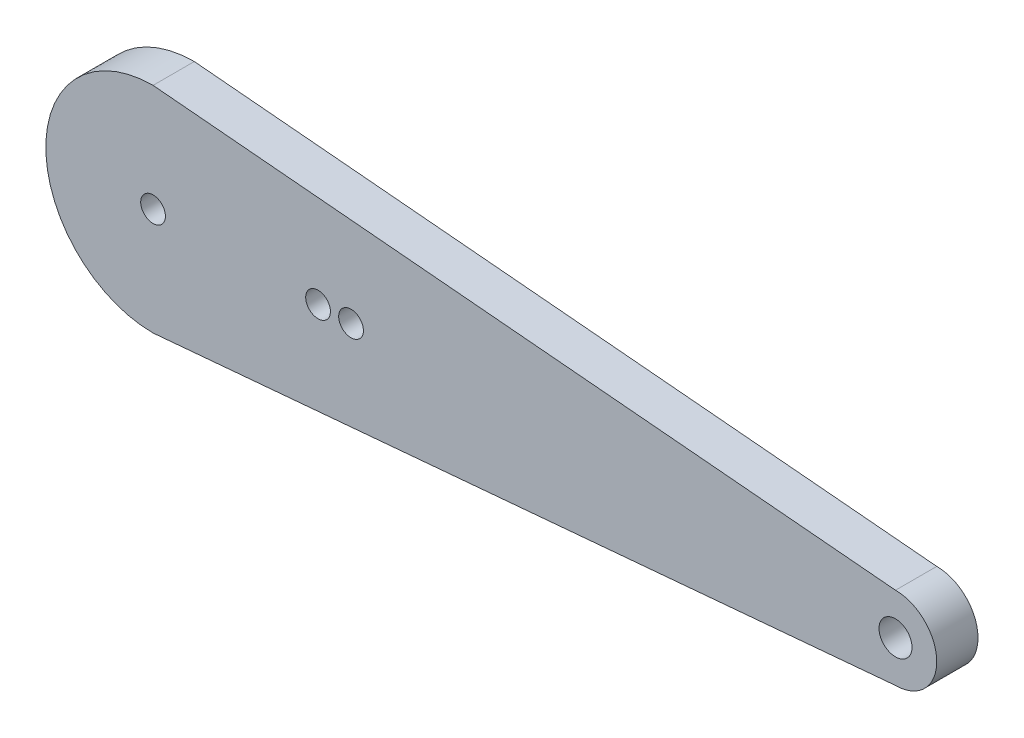
ISO-10303-21;
HEADER;
FILE_DESCRIPTION(('STEP AP214'),'2;1');
FILE_NAME('part.step','',(''),(''),'','','');
FILE_SCHEMA(('AUTOMOTIVE_DESIGN { 1 0 10303 214 1 1 1 1 }'));
ENDSEC;
DATA;
#1=APPLICATION_CONTEXT('core data for automotive mechanical design processes');
#2=APPLICATION_PROTOCOL_DEFINITION('international standard','automotive_design',2000,#1);
#3=PRODUCT_CONTEXT('',#1,'mechanical');
#4=PRODUCT('Part','Part','',(#3));
#5=PRODUCT_RELATED_PRODUCT_CATEGORY('part','',(#4));
#6=PRODUCT_DEFINITION_FORMATION('','',#4);
#7=PRODUCT_DEFINITION_CONTEXT('part definition',#1,'design');
#8=PRODUCT_DEFINITION('design','',#6,#7);
#9=PRODUCT_DEFINITION_SHAPE('','',#8);
#10=(LENGTH_UNIT() NAMED_UNIT(*) SI_UNIT(.MILLI.,.METRE.));
#11=(NAMED_UNIT(*) PLANE_ANGLE_UNIT() SI_UNIT($,.RADIAN.));
#12=(NAMED_UNIT(*) SI_UNIT($,.STERADIAN.) SOLID_ANGLE_UNIT());
#13=UNCERTAINTY_MEASURE_WITH_UNIT(LENGTH_MEASURE(1.E-05),#10,'distance_accuracy_value','');
#14=(GEOMETRIC_REPRESENTATION_CONTEXT(3) GLOBAL_UNCERTAINTY_ASSIGNED_CONTEXT((#13)) GLOBAL_UNIT_ASSIGNED_CONTEXT((#10,
#11,#12)) REPRESENTATION_CONTEXT('',''));
#15=CARTESIAN_POINT('',(0.,0.,0.));
#16=DIRECTION('',(0.,0.,1.));
#17=DIRECTION('',(1.,0.,0.));
#18=AXIS2_PLACEMENT_3D('',#15,#16,#17);
#19=CARTESIAN_POINT('',(45.,0.,5.));
#20=DIRECTION('',(0.,0.,-1.));
#21=DIRECTION('',(-1.,0.,0.));
#22=AXIS2_PLACEMENT_3D('',#19,#20,#21);
#23=CYLINDRICAL_SURFACE('',#22,5.);
#24=CARTESIAN_POINT('',(45.,0.,0.));
#25=DIRECTION('',(0.,0.,1.));
#26=DIRECTION('',(1.,0.,0.));
#27=AXIS2_PLACEMENT_3D('',#24,#25,#26);
#28=CIRCLE('',#27,5.);
#29=CARTESIAN_POINT('',(45.,5.,0.));
#30=VERTEX_POINT('',#29);
#31=CARTESIAN_POINT('',(45.,-5.,0.));
#32=VERTEX_POINT('',#31);
#33=EDGE_CURVE('E117',#30,#32,#28,.F.);
#34=ORIENTED_EDGE('',*,*,#33,.F.);
#35=DIRECTION('',(0.,0.,-1.));
#36=VECTOR('',#35,1.);
#37=CARTESIAN_POINT('',(45.,5.,5.));
#38=LINE('',#37,#36);
#39=CARTESIAN_POINT('',(45.,5.,5.));
#40=VERTEX_POINT('',#39);
#41=EDGE_CURVE('E11',#40,#30,#38,.T.);
#42=ORIENTED_EDGE('',*,*,#41,.F.);
#43=CARTESIAN_POINT('',(45.,0.,5.));
#44=DIRECTION('',(0.,0.,1.));
#45=DIRECTION('',(1.,0.,0.));
#46=AXIS2_PLACEMENT_3D('',#43,#44,#45);
#47=CIRCLE('',#46,5.);
#48=CARTESIAN_POINT('',(45.,-5.,5.));
#49=VERTEX_POINT('',#48);
#50=EDGE_CURVE('E98',#40,#49,#47,.F.);
#51=ORIENTED_EDGE('',*,*,#50,.T.);
#52=DIRECTION('',(0.,0.,-1.));
#53=VECTOR('',#52,1.);
#54=CARTESIAN_POINT('',(45.,-5.,5.));
#55=LINE('',#54,#53);
#56=EDGE_CURVE('E76',#49,#32,#55,.T.);
#57=ORIENTED_EDGE('',*,*,#56,.T.);
#58=EDGE_LOOP('',(#34,#42,#51,#57));
#59=FACE_BOUND('',#58,.T.);
#60=ADVANCED_FACE('F36',(#59),#23,.T.);
#61=CARTESIAN_POINT('',(0.793728564429201,8.92944634982851,5.));
#62=DIRECTION('',(0.0885397902837944,0.996072640692687,0.));
#63=DIRECTION('',(-0.996072640692687,0.0885397902837944,0.));
#64=AXIS2_PLACEMENT_3D('',#61,#62,#63);
#65=PLANE('',#64);
#66=DIRECTION('',(0.996072640692687,-0.0885397902837944,0.));
#67=VECTOR('',#66,1.);
#68=CARTESIAN_POINT('',(0.793728564429201,8.92944634982851,0.));
#69=LINE('',#68,#67);
#70=CARTESIAN_POINT('',(-45.,13.,0.));
#71=VERTEX_POINT('',#70);
#72=EDGE_CURVE('E88',#71,#30,#69,.T.);
#73=ORIENTED_EDGE('',*,*,#72,.F.);
#74=DIRECTION('',(0.,0.,-1.));
#75=VECTOR('',#74,1.);
#76=CARTESIAN_POINT('',(-45.,13.,5.));
#77=LINE('',#76,#75);
#78=CARTESIAN_POINT('',(-45.,13.,5.));
#79=VERTEX_POINT('',#78);
#80=EDGE_CURVE('E45',#79,#71,#77,.T.);
#81=ORIENTED_EDGE('',*,*,#80,.F.);
#82=DIRECTION('',(0.996072640692687,-0.0885397902837944,0.));
#83=VECTOR('',#82,1.);
#84=CARTESIAN_POINT('',(0.793728564429201,8.92944634982851,5.));
#85=LINE('',#84,#83);
#86=EDGE_CURVE('E86',#79,#40,#85,.T.);
#87=ORIENTED_EDGE('',*,*,#86,.T.);
#88=ORIENTED_EDGE('',*,*,#41,.T.);
#89=EDGE_LOOP('',(#73,#81,#87,#88));
#90=FACE_BOUND('',#89,.T.);
#91=ADVANCED_FACE('F84',(#90),#65,.T.);
#92=CARTESIAN_POINT('',(-45.,0.,5.));
#93=DIRECTION('',(0.,0.,-1.));
#94=DIRECTION('',(-1.,0.,0.));
#95=AXIS2_PLACEMENT_3D('',#92,#93,#94);
#96=CYLINDRICAL_SURFACE('',#95,13.);
#97=CARTESIAN_POINT('',(-45.,0.,0.));
#98=DIRECTION('',(0.,0.,1.));
#99=DIRECTION('',(1.,0.,0.));
#100=AXIS2_PLACEMENT_3D('',#97,#98,#99);
#101=CIRCLE('',#100,13.);
#102=CARTESIAN_POINT('',(-45.,-13.,0.));
#103=VERTEX_POINT('',#102);
#104=EDGE_CURVE('E120',#71,#103,#101,.T.);
#105=ORIENTED_EDGE('',*,*,#104,.T.);
#106=DIRECTION('',(0.,0.,-1.));
#107=VECTOR('',#106,1.);
#108=CARTESIAN_POINT('',(-45.,-13.,5.));
#109=LINE('',#108,#107);
#110=CARTESIAN_POINT('',(-45.,-13.,5.));
#111=VERTEX_POINT('',#110);
#112=EDGE_CURVE('E91',#111,#103,#109,.T.);
#113=ORIENTED_EDGE('',*,*,#112,.F.);
#114=CARTESIAN_POINT('',(-45.,0.,5.));
#115=DIRECTION('',(0.,0.,1.));
#116=DIRECTION('',(1.,0.,0.));
#117=AXIS2_PLACEMENT_3D('',#114,#115,#116);
#118=CIRCLE('',#117,13.);
#119=EDGE_CURVE('E93',#79,#111,#118,.T.);
#120=ORIENTED_EDGE('',*,*,#119,.F.);
#121=ORIENTED_EDGE('',*,*,#80,.T.);
#122=EDGE_LOOP('',(#105,#113,#120,#121));
#123=FACE_BOUND('',#122,.T.);
#124=ADVANCED_FACE('F94',(#123),#96,.T.);
#125=CARTESIAN_POINT('',(0.793728564429201,-8.92944634982851,5.));
#126=DIRECTION('',(-0.0885397902837944,0.996072640692687,0.));
#127=DIRECTION('',(-0.996072640692687,-0.0885397902837944,0.));
#128=AXIS2_PLACEMENT_3D('',#125,#126,#127);
#129=PLANE('',#128);
#130=DIRECTION('',(0.996072640692687,0.0885397902837944,0.));
#131=VECTOR('',#130,1.);
#132=CARTESIAN_POINT('',(0.793728564429201,-8.92944634982851,0.));
#133=LINE('',#132,#131);
#134=EDGE_CURVE('E69',#103,#32,#133,.T.);
#135=ORIENTED_EDGE('',*,*,#134,.T.);
#136=ORIENTED_EDGE('',*,*,#56,.F.);
#137=DIRECTION('',(0.996072640692687,0.0885397902837944,0.));
#138=VECTOR('',#137,1.);
#139=CARTESIAN_POINT('',(0.793728564429201,-8.92944634982851,5.));
#140=LINE('',#139,#138);
#141=EDGE_CURVE('E53',#111,#49,#140,.T.);
#142=ORIENTED_EDGE('',*,*,#141,.F.);
#143=ORIENTED_EDGE('',*,*,#112,.T.);
#144=EDGE_LOOP('',(#135,#136,#142,#143));
#145=FACE_BOUND('',#144,.T.);
#146=ADVANCED_FACE('F129',(#145),#129,.F.);
#147=CARTESIAN_POINT('',(-45.,0.,5.));
#148=DIRECTION('',(0.,0.,-1.));
#149=DIRECTION('',(-1.,0.,0.));
#150=AXIS2_PLACEMENT_3D('',#147,#148,#149);
#151=CYLINDRICAL_SURFACE('',#150,1.5);
#152=CARTESIAN_POINT('',(-45.,0.,5.));
#153=DIRECTION('',(0.,0.,1.));
#154=DIRECTION('',(1.,0.,0.));
#155=AXIS2_PLACEMENT_3D('',#152,#153,#154);
#156=CIRCLE('',#155,1.5);
#157=CARTESIAN_POINT('',(-43.5,0.,5.));
#158=VERTEX_POINT('',#157);
#159=EDGE_CURVE('E100',#158,#158,#156,.T.);
#160=ORIENTED_EDGE('',*,*,#159,.T.);
#161=EDGE_LOOP('',(#160));
#162=FACE_BOUND('',#161,.T.);
#163=CARTESIAN_POINT('',(-45.,0.,0.));
#164=DIRECTION('',(0.,0.,1.));
#165=DIRECTION('',(1.,0.,0.));
#166=AXIS2_PLACEMENT_3D('',#163,#164,#165);
#167=CIRCLE('',#166,1.5);
#168=CARTESIAN_POINT('',(-43.5,0.,0.));
#169=VERTEX_POINT('',#168);
#170=EDGE_CURVE('E114',#169,#169,#167,.T.);
#171=ORIENTED_EDGE('',*,*,#170,.F.);
#172=EDGE_LOOP('',(#171));
#173=FACE_BOUND('',#172,.T.);
#174=ADVANCED_FACE('F140',(#162,#173),#151,.F.);
#175=CARTESIAN_POINT('',(-25.,0.,5.));
#176=DIRECTION('',(0.,0.,-1.));
#177=DIRECTION('',(-1.,0.,0.));
#178=AXIS2_PLACEMENT_3D('',#175,#176,#177);
#179=CYLINDRICAL_SURFACE('',#178,1.5);
#180=CARTESIAN_POINT('',(-25.,0.,5.));
#181=DIRECTION('',(0.,0.,1.));
#182=DIRECTION('',(1.,0.,0.));
#183=AXIS2_PLACEMENT_3D('',#180,#181,#182);
#184=CIRCLE('',#183,1.5);
#185=CARTESIAN_POINT('',(-23.5,0.,5.));
#186=VERTEX_POINT('',#185);
#187=EDGE_CURVE('E154',#186,#186,#184,.T.);
#188=ORIENTED_EDGE('',*,*,#187,.T.);
#189=EDGE_LOOP('',(#188));
#190=FACE_BOUND('',#189,.T.);
#191=CARTESIAN_POINT('',(-25.,0.,0.));
#192=DIRECTION('',(0.,0.,1.));
#193=DIRECTION('',(1.,0.,0.));
#194=AXIS2_PLACEMENT_3D('',#191,#192,#193);
#195=CIRCLE('',#194,1.5);
#196=CARTESIAN_POINT('',(-23.5,0.,0.));
#197=VERTEX_POINT('',#196);
#198=EDGE_CURVE('E111',#197,#197,#195,.T.);
#199=ORIENTED_EDGE('',*,*,#198,.F.);
#200=EDGE_LOOP('',(#199));
#201=FACE_BOUND('',#200,.T.);
#202=ADVANCED_FACE('F142',(#190,#201),#179,.F.);
#203=CARTESIAN_POINT('',(-21.,0.,5.));
#204=DIRECTION('',(0.,0.,-1.));
#205=DIRECTION('',(-1.,0.,0.));
#206=AXIS2_PLACEMENT_3D('',#203,#204,#205);
#207=CYLINDRICAL_SURFACE('',#206,1.5);
#208=CARTESIAN_POINT('',(-21.,0.,5.));
#209=DIRECTION('',(0.,0.,1.));
#210=DIRECTION('',(1.,0.,0.));
#211=AXIS2_PLACEMENT_3D('',#208,#209,#210);
#212=CIRCLE('',#211,1.5);
#213=CARTESIAN_POINT('',(-19.5,0.,5.));
#214=VERTEX_POINT('',#213);
#215=EDGE_CURVE('E126',#214,#214,#212,.T.);
#216=ORIENTED_EDGE('',*,*,#215,.T.);
#217=EDGE_LOOP('',(#216));
#218=FACE_BOUND('',#217,.T.);
#219=CARTESIAN_POINT('',(-21.,0.,0.));
#220=DIRECTION('',(0.,0.,1.));
#221=DIRECTION('',(1.,0.,0.));
#222=AXIS2_PLACEMENT_3D('',#219,#220,#221);
#223=CIRCLE('',#222,1.5);
#224=CARTESIAN_POINT('',(-19.5,0.,0.));
#225=VERTEX_POINT('',#224);
#226=EDGE_CURVE('E108',#225,#225,#223,.T.);
#227=ORIENTED_EDGE('',*,*,#226,.F.);
#228=EDGE_LOOP('',(#227));
#229=FACE_BOUND('',#228,.T.);
#230=ADVANCED_FACE('F38',(#218,#229),#207,.F.);
#231=CARTESIAN_POINT('',(45.,0.,5.));
#232=DIRECTION('',(0.,0.,-1.));
#233=DIRECTION('',(-1.,0.,0.));
#234=AXIS2_PLACEMENT_3D('',#231,#232,#233);
#235=CYLINDRICAL_SURFACE('',#234,2.);
#236=CARTESIAN_POINT('',(45.,0.,5.));
#237=DIRECTION('',(0.,0.,1.));
#238=DIRECTION('',(1.,0.,0.));
#239=AXIS2_PLACEMENT_3D('',#236,#237,#238);
#240=CIRCLE('',#239,2.);
#241=CARTESIAN_POINT('',(47.,0.,5.));
#242=VERTEX_POINT('',#241);
#243=EDGE_CURVE('E105',#242,#242,#240,.F.);
#244=ORIENTED_EDGE('',*,*,#243,.F.);
#245=EDGE_LOOP('',(#244));
#246=FACE_BOUND('',#245,.T.);
#247=CARTESIAN_POINT('',(45.,0.,0.));
#248=DIRECTION('',(0.,0.,1.));
#249=DIRECTION('',(1.,0.,0.));
#250=AXIS2_PLACEMENT_3D('',#247,#248,#249);
#251=CIRCLE('',#250,2.);
#252=CARTESIAN_POINT('',(47.,0.,0.));
#253=VERTEX_POINT('',#252);
#254=EDGE_CURVE('E123',#253,#253,#251,.F.);
#255=ORIENTED_EDGE('',*,*,#254,.T.);
#256=EDGE_LOOP('',(#255));
#257=FACE_BOUND('',#256,.T.);
#258=ADVANCED_FACE('F149',(#246,#257),#235,.F.);
#259=CARTESIAN_POINT('',(0.,0.,5.));
#260=DIRECTION('',(0.,0.,1.));
#261=DIRECTION('',(1.,0.,0.));
#262=AXIS2_PLACEMENT_3D('',#259,#260,#261);
#263=PLANE('',#262);
#264=ORIENTED_EDGE('',*,*,#215,.F.);
#265=EDGE_LOOP('',(#264));
#266=FACE_BOUND('',#265,.T.);
#267=ORIENTED_EDGE('',*,*,#187,.F.);
#268=EDGE_LOOP('',(#267));
#269=FACE_BOUND('',#268,.T.);
#270=ORIENTED_EDGE('',*,*,#159,.F.);
#271=EDGE_LOOP('',(#270));
#272=FACE_BOUND('',#271,.T.);
#273=ORIENTED_EDGE('',*,*,#50,.F.);
#274=ORIENTED_EDGE('',*,*,#86,.F.);
#275=ORIENTED_EDGE('',*,*,#119,.T.);
#276=ORIENTED_EDGE('',*,*,#141,.T.);
#277=EDGE_LOOP('',(#273,#274,#275,#276));
#278=FACE_BOUND('',#277,.T.);
#279=ORIENTED_EDGE('',*,*,#243,.T.);
#280=EDGE_LOOP('',(#279));
#281=FACE_BOUND('',#280,.T.);
#282=ADVANCED_FACE('F96',(#266,#269,#272,#278,#281),#263,.T.);
#283=CARTESIAN_POINT('',(0.,0.,0.));
#284=DIRECTION('',(0.,0.,1.));
#285=DIRECTION('',(1.,0.,0.));
#286=AXIS2_PLACEMENT_3D('',#283,#284,#285);
#287=PLANE('',#286);
#288=ORIENTED_EDGE('',*,*,#226,.T.);
#289=EDGE_LOOP('',(#288));
#290=FACE_BOUND('',#289,.T.);
#291=ORIENTED_EDGE('',*,*,#198,.T.);
#292=EDGE_LOOP('',(#291));
#293=FACE_BOUND('',#292,.T.);
#294=ORIENTED_EDGE('',*,*,#170,.T.);
#295=EDGE_LOOP('',(#294));
#296=FACE_BOUND('',#295,.T.);
#297=ORIENTED_EDGE('',*,*,#33,.T.);
#298=ORIENTED_EDGE('',*,*,#134,.F.);
#299=ORIENTED_EDGE('',*,*,#104,.F.);
#300=ORIENTED_EDGE('',*,*,#72,.T.);
#301=EDGE_LOOP('',(#297,#298,#299,#300));
#302=FACE_BOUND('',#301,.T.);
#303=ORIENTED_EDGE('',*,*,#254,.F.);
#304=EDGE_LOOP('',(#303));
#305=FACE_BOUND('',#304,.T.);
#306=ADVANCED_FACE('F130',(#290,#293,#296,#302,#305),#287,.F.);
#307=CLOSED_SHELL('',(#60,#91,#124,#146,#174,#202,#230,#258,#282,#306));
#308=MANIFOLD_SOLID_BREP('B2',#307);
#309=ADVANCED_BREP_SHAPE_REPRESENTATION('',(#18,#308),#14);
#310=SHAPE_DEFINITION_REPRESENTATION(#9,#309);
ENDSEC;
END-ISO-10303-21;
